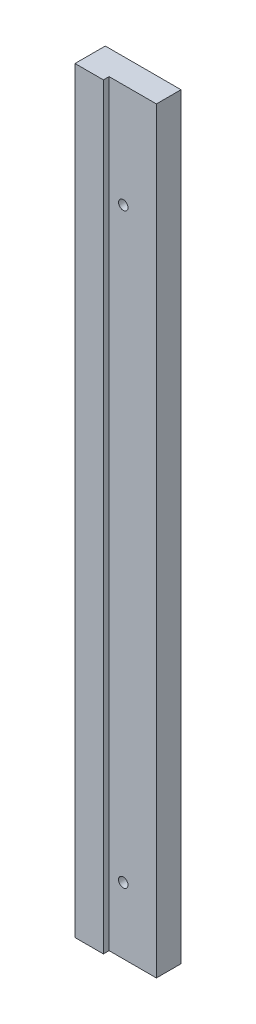
ISO-10303-21;
HEADER;
FILE_DESCRIPTION(('STEP AP214'),'2;1');
FILE_NAME('part.step','',(''),(''),'','','');
FILE_SCHEMA(('AUTOMOTIVE_DESIGN { 1 0 10303 214 1 1 1 1 }'));
ENDSEC;
DATA;
#1=APPLICATION_CONTEXT('core data for automotive mechanical design processes');
#2=APPLICATION_PROTOCOL_DEFINITION('international standard','automotive_design',2000,#1);
#3=PRODUCT_CONTEXT('',#1,'mechanical');
#4=PRODUCT('Part','Part','',(#3));
#5=PRODUCT_RELATED_PRODUCT_CATEGORY('part','',(#4));
#6=PRODUCT_DEFINITION_FORMATION('','',#4);
#7=PRODUCT_DEFINITION_CONTEXT('part definition',#1,'design');
#8=PRODUCT_DEFINITION('design','',#6,#7);
#9=PRODUCT_DEFINITION_SHAPE('','',#8);
#10=(LENGTH_UNIT() NAMED_UNIT(*) SI_UNIT(.MILLI.,.METRE.));
#11=(NAMED_UNIT(*) PLANE_ANGLE_UNIT() SI_UNIT($,.RADIAN.));
#12=(NAMED_UNIT(*) SI_UNIT($,.STERADIAN.) SOLID_ANGLE_UNIT());
#13=UNCERTAINTY_MEASURE_WITH_UNIT(LENGTH_MEASURE(1.E-05),#10,'distance_accuracy_value','');
#14=(GEOMETRIC_REPRESENTATION_CONTEXT(3) GLOBAL_UNCERTAINTY_ASSIGNED_CONTEXT((#13)) GLOBAL_UNIT_ASSIGNED_CONTEXT((#10,
#11,#12)) REPRESENTATION_CONTEXT('',''));
#15=CARTESIAN_POINT('',(0.,0.,0.));
#16=DIRECTION('',(0.,0.,1.));
#17=DIRECTION('',(1.,0.,0.));
#18=AXIS2_PLACEMENT_3D('',#15,#16,#17);
#19=CARTESIAN_POINT('',(20.,200.,16.));
#20=DIRECTION('',(-1.,0.,0.));
#21=DIRECTION('',(0.,-1.,0.));
#22=AXIS2_PLACEMENT_3D('',#19,#20,#21);
#23=PLANE('',#22);
#24=DIRECTION('',(0.,0.,-1.));
#25=VECTOR('',#24,1.);
#26=CARTESIAN_POINT('',(20.,200.,16.));
#27=LINE('',#26,#25);
#28=CARTESIAN_POINT('',(19.9999999999997,200.,13.));
#29=VERTEX_POINT('',#28);
#30=CARTESIAN_POINT('',(20.,200.,0.));
#31=VERTEX_POINT('',#30);
#32=EDGE_CURVE('E11',#29,#31,#27,.T.);
#33=ORIENTED_EDGE('',*,*,#32,.F.);
#34=DIRECTION('',(0.,-1.,0.));
#35=VECTOR('',#34,1.);
#36=CARTESIAN_POINT('',(19.9999999999997,200.001,13.));
#37=LINE('',#36,#35);
#38=CARTESIAN_POINT('',(20.,-200.,13.));
#39=VERTEX_POINT('',#38);
#40=EDGE_CURVE('E89',#29,#39,#37,.T.);
#41=ORIENTED_EDGE('',*,*,#40,.T.);
#42=DIRECTION('',(0.,0.,-1.));
#43=VECTOR('',#42,1.);
#44=CARTESIAN_POINT('',(20.,-200.,16.));
#45=LINE('',#44,#43);
#46=CARTESIAN_POINT('',(20.,-200.,0.));
#47=VERTEX_POINT('',#46);
#48=EDGE_CURVE('E82',#39,#47,#45,.T.);
#49=ORIENTED_EDGE('',*,*,#48,.T.);
#50=DIRECTION('',(0.,1.,0.));
#51=VECTOR('',#50,1.);
#52=CARTESIAN_POINT('',(20.,200.,0.));
#53=LINE('',#52,#51);
#54=EDGE_CURVE('E86',#47,#31,#53,.T.);
#55=ORIENTED_EDGE('',*,*,#54,.T.);
#56=EDGE_LOOP('',(#33,#41,#49,#55));
#57=FACE_BOUND('',#56,.T.);
#58=ADVANCED_FACE('F39',(#57),#23,.F.);
#59=CARTESIAN_POINT('',(-20.,200.,16.));
#60=DIRECTION('',(0.,-1.,0.));
#61=DIRECTION('',(0.,0.,-1.));
#62=AXIS2_PLACEMENT_3D('',#59,#60,#61);
#63=PLANE('',#62);
#64=DIRECTION('',(-1.,0.,0.));
#65=VECTOR('',#64,1.);
#66=CARTESIAN_POINT('',(-20.,200.,16.));
#67=LINE('',#66,#65);
#68=CARTESIAN_POINT('',(-5.00000000000029,200.,16.));
#69=VERTEX_POINT('',#68);
#70=CARTESIAN_POINT('',(-20.,200.,16.));
#71=VERTEX_POINT('',#70);
#72=EDGE_CURVE('E102',#69,#71,#67,.T.);
#73=ORIENTED_EDGE('',*,*,#72,.F.);
#74=DIRECTION('',(0.,0.,1.));
#75=VECTOR('',#74,1.);
#76=CARTESIAN_POINT('',(-5.00000000000029,200.,16.));
#77=LINE('',#76,#75);
#78=CARTESIAN_POINT('',(-5.00000000000029,200.,13.));
#79=VERTEX_POINT('',#78);
#80=EDGE_CURVE('E54',#79,#69,#77,.T.);
#81=ORIENTED_EDGE('',*,*,#80,.F.);
#82=DIRECTION('',(-1.,0.,0.));
#83=VECTOR('',#82,1.);
#84=CARTESIAN_POINT('',(-5.00000000000029,200.,13.));
#85=LINE('',#84,#83);
#86=EDGE_CURVE('E108',#29,#79,#85,.T.);
#87=ORIENTED_EDGE('',*,*,#86,.F.);
#88=ORIENTED_EDGE('',*,*,#32,.T.);
#89=DIRECTION('',(-1.,0.,0.));
#90=VECTOR('',#89,1.);
#91=CARTESIAN_POINT('',(-20.,200.,0.));
#92=LINE('',#91,#90);
#93=CARTESIAN_POINT('',(-20.,200.,0.));
#94=VERTEX_POINT('',#93);
#95=EDGE_CURVE('E107',#31,#94,#92,.T.);
#96=ORIENTED_EDGE('',*,*,#95,.T.);
#97=DIRECTION('',(0.,0.,-1.));
#98=VECTOR('',#97,1.);
#99=CARTESIAN_POINT('',(-20.,200.,16.));
#100=LINE('',#99,#98);
#101=EDGE_CURVE('E47',#71,#94,#100,.T.);
#102=ORIENTED_EDGE('',*,*,#101,.F.);
#103=EDGE_LOOP('',(#73,#81,#87,#88,#96,#102));
#104=FACE_BOUND('',#103,.T.);
#105=ADVANCED_FACE('F125',(#104),#63,.F.);
#106=CARTESIAN_POINT('',(-20.,200.,16.));
#107=DIRECTION('',(1.,0.,0.));
#108=DIRECTION('',(0.,1.,0.));
#109=AXIS2_PLACEMENT_3D('',#106,#107,#108);
#110=PLANE('',#109);
#111=DIRECTION('',(0.,-1.,0.));
#112=VECTOR('',#111,1.);
#113=CARTESIAN_POINT('',(-20.,200.,0.));
#114=LINE('',#113,#112);
#115=CARTESIAN_POINT('',(-20.,-200.,0.));
#116=VERTEX_POINT('',#115);
#117=EDGE_CURVE('E103',#94,#116,#114,.T.);
#118=ORIENTED_EDGE('',*,*,#117,.T.);
#119=DIRECTION('',(0.,0.,-1.));
#120=VECTOR('',#119,1.);
#121=CARTESIAN_POINT('',(-20.,-200.,16.));
#122=LINE('',#121,#120);
#123=CARTESIAN_POINT('',(-20.,-200.,16.));
#124=VERTEX_POINT('',#123);
#125=EDGE_CURVE('E92',#124,#116,#122,.T.);
#126=ORIENTED_EDGE('',*,*,#125,.F.);
#127=DIRECTION('',(0.,-1.,0.));
#128=VECTOR('',#127,1.);
#129=CARTESIAN_POINT('',(-20.,200.,16.));
#130=LINE('',#129,#128);
#131=EDGE_CURVE('E63',#71,#124,#130,.T.);
#132=ORIENTED_EDGE('',*,*,#131,.F.);
#133=ORIENTED_EDGE('',*,*,#101,.T.);
#134=EDGE_LOOP('',(#118,#126,#132,#133));
#135=FACE_BOUND('',#134,.T.);
#136=ADVANCED_FACE('F122',(#135),#110,.F.);
#137=CARTESIAN_POINT('',(-20.,-200.,16.));
#138=DIRECTION('',(0.,1.,0.));
#139=DIRECTION('',(0.,0.,1.));
#140=AXIS2_PLACEMENT_3D('',#137,#138,#139);
#141=PLANE('',#140);
#142=DIRECTION('',(1.,0.,0.));
#143=VECTOR('',#142,1.);
#144=CARTESIAN_POINT('',(-4.99999999999998,-200.,13.));
#145=LINE('',#144,#143);
#146=CARTESIAN_POINT('',(-4.99999999999998,-200.,13.));
#147=VERTEX_POINT('',#146);
#148=EDGE_CURVE('E142',#147,#39,#145,.T.);
#149=ORIENTED_EDGE('',*,*,#148,.F.);
#150=DIRECTION('',(0.,0.,-1.));
#151=VECTOR('',#150,1.);
#152=CARTESIAN_POINT('',(-4.99999999999998,-200.,16.));
#153=LINE('',#152,#151);
#154=CARTESIAN_POINT('',(-4.99999999999998,-200.,16.));
#155=VERTEX_POINT('',#154);
#156=EDGE_CURVE('E141',#155,#147,#153,.T.);
#157=ORIENTED_EDGE('',*,*,#156,.F.);
#158=DIRECTION('',(1.,0.,0.));
#159=VECTOR('',#158,1.);
#160=CARTESIAN_POINT('',(-20.,-200.,16.));
#161=LINE('',#160,#159);
#162=EDGE_CURVE('E93',#124,#155,#161,.T.);
#163=ORIENTED_EDGE('',*,*,#162,.F.);
#164=ORIENTED_EDGE('',*,*,#125,.T.);
#165=DIRECTION('',(1.,0.,0.));
#166=VECTOR('',#165,1.);
#167=CARTESIAN_POINT('',(-20.,-200.,0.));
#168=LINE('',#167,#166);
#169=EDGE_CURVE('E97',#116,#47,#168,.T.);
#170=ORIENTED_EDGE('',*,*,#169,.T.);
#171=ORIENTED_EDGE('',*,*,#48,.F.);
#172=EDGE_LOOP('',(#149,#157,#163,#164,#170,#171));
#173=FACE_BOUND('',#172,.T.);
#174=ADVANCED_FACE('F98',(#173),#141,.F.);
#175=CARTESIAN_POINT('',(0.,0.,16.));
#176=DIRECTION('',(0.,0.,1.));
#177=DIRECTION('',(1.,0.,0.));
#178=AXIS2_PLACEMENT_3D('',#175,#176,#177);
#179=PLANE('',#178);
#180=DIRECTION('',(0.,-1.,0.));
#181=VECTOR('',#180,1.);
#182=CARTESIAN_POINT('',(-5.00000000000029,200.001,16.));
#183=LINE('',#182,#181);
#184=EDGE_CURVE('E112',#69,#155,#183,.T.);
#185=ORIENTED_EDGE('',*,*,#184,.F.);
#186=ORIENTED_EDGE('',*,*,#72,.T.);
#187=ORIENTED_EDGE('',*,*,#131,.T.);
#188=ORIENTED_EDGE('',*,*,#162,.T.);
#189=EDGE_LOOP('',(#185,#186,#187,#188));
#190=FACE_BOUND('',#189,.T.);
#191=ADVANCED_FACE('F156',(#190),#179,.T.);
#192=CARTESIAN_POINT('',(0.,0.,0.));
#193=DIRECTION('',(0.,0.,1.));
#194=DIRECTION('',(1.,0.,0.));
#195=AXIS2_PLACEMENT_3D('',#192,#193,#194);
#196=PLANE('',#195);
#197=CARTESIAN_POINT('',(2.50000000000011,145.,0.));
#198=DIRECTION('',(0.,0.,-1.));
#199=DIRECTION('',(-1.,0.,0.));
#200=AXIS2_PLACEMENT_3D('',#197,#198,#199);
#201=CIRCLE('',#200,2.5);
#202=CARTESIAN_POINT('',(1.15359111152458E-13,145.,0.));
#203=VERTEX_POINT('',#202);
#204=EDGE_CURVE('E249',#203,#203,#201,.T.);
#205=ORIENTED_EDGE('',*,*,#204,.F.);
#206=EDGE_LOOP('',(#205));
#207=FACE_BOUND('',#206,.T.);
#208=CARTESIAN_POINT('',(2.50000000000009,-165.,0.));
#209=DIRECTION('',(0.,0.,-1.));
#210=DIRECTION('',(-1.,0.,0.));
#211=AXIS2_PLACEMENT_3D('',#208,#209,#210);
#212=CIRCLE('',#211,2.5);
#213=CARTESIAN_POINT('',(0.,-165.,0.));
#214=VERTEX_POINT('',#213);
#215=EDGE_CURVE('E149',#214,#214,#212,.T.);
#216=ORIENTED_EDGE('',*,*,#215,.F.);
#217=EDGE_LOOP('',(#216));
#218=FACE_BOUND('',#217,.T.);
#219=ORIENTED_EDGE('',*,*,#54,.F.);
#220=ORIENTED_EDGE('',*,*,#169,.F.);
#221=ORIENTED_EDGE('',*,*,#117,.F.);
#222=ORIENTED_EDGE('',*,*,#95,.F.);
#223=EDGE_LOOP('',(#219,#220,#221,#222));
#224=FACE_BOUND('',#223,.T.);
#225=ADVANCED_FACE('F106',(#207,#218,#224),#196,.F.);
#226=CARTESIAN_POINT('',(-5.00000000000029,200.001,16.));
#227=DIRECTION('',(-1.,0.,0.));
#228=DIRECTION('',(0.,-1.,0.));
#229=AXIS2_PLACEMENT_3D('',#226,#227,#228);
#230=PLANE('',#229);
#231=ORIENTED_EDGE('',*,*,#80,.T.);
#232=ORIENTED_EDGE('',*,*,#184,.T.);
#233=ORIENTED_EDGE('',*,*,#156,.T.);
#234=DIRECTION('',(0.,-1.,0.));
#235=VECTOR('',#234,1.);
#236=CARTESIAN_POINT('',(-5.00000000000029,200.001,13.));
#237=LINE('',#236,#235);
#238=EDGE_CURVE('E138',#79,#147,#237,.T.);
#239=ORIENTED_EDGE('',*,*,#238,.F.);
#240=EDGE_LOOP('',(#231,#232,#233,#239));
#241=FACE_BOUND('',#240,.T.);
#242=ADVANCED_FACE('F139',(#241),#230,.F.);
#243=CARTESIAN_POINT('',(-5.00000000000029,200.001,13.));
#244=DIRECTION('',(0.,0.,-1.));
#245=DIRECTION('',(-1.,0.,0.));
#246=AXIS2_PLACEMENT_3D('',#243,#244,#245);
#247=PLANE('',#246);
#248=CARTESIAN_POINT('',(2.50000000000011,145.,13.));
#249=DIRECTION('',(0.,0.,-1.));
#250=DIRECTION('',(-1.,0.,0.));
#251=AXIS2_PLACEMENT_3D('',#248,#249,#250);
#252=CIRCLE('',#251,2.5);
#253=CARTESIAN_POINT('',(1.1666015375944E-13,145.,13.));
#254=VERTEX_POINT('',#253);
#255=EDGE_CURVE('E42',#254,#254,#252,.T.);
#256=ORIENTED_EDGE('',*,*,#255,.T.);
#257=EDGE_LOOP('',(#256));
#258=FACE_BOUND('',#257,.T.);
#259=CARTESIAN_POINT('',(2.50000000000009,-165.,13.));
#260=DIRECTION('',(0.,0.,-1.));
#261=DIRECTION('',(-1.,0.,0.));
#262=AXIS2_PLACEMENT_3D('',#259,#260,#261);
#263=CIRCLE('',#262,2.5);
#264=CARTESIAN_POINT('',(0.,-165.,13.));
#265=VERTEX_POINT('',#264);
#266=EDGE_CURVE('E145',#265,#265,#263,.T.);
#267=ORIENTED_EDGE('',*,*,#266,.T.);
#268=EDGE_LOOP('',(#267));
#269=FACE_BOUND('',#268,.T.);
#270=ORIENTED_EDGE('',*,*,#86,.T.);
#271=ORIENTED_EDGE('',*,*,#238,.T.);
#272=ORIENTED_EDGE('',*,*,#148,.T.);
#273=ORIENTED_EDGE('',*,*,#40,.F.);
#274=EDGE_LOOP('',(#270,#271,#272,#273));
#275=FACE_BOUND('',#274,.T.);
#276=ADVANCED_FACE('F144',(#258,#269,#275),#247,.F.);
#277=CARTESIAN_POINT('',(2.50000000000009,-165.,0.));
#278=DIRECTION('',(0.,0.,-1.));
#279=DIRECTION('',(-1.,0.,0.));
#280=AXIS2_PLACEMENT_3D('',#277,#278,#279);
#281=CYLINDRICAL_SURFACE('',#280,2.5);
#282=ORIENTED_EDGE('',*,*,#215,.T.);
#283=EDGE_LOOP('',(#282));
#284=FACE_BOUND('',#283,.T.);
#285=ORIENTED_EDGE('',*,*,#266,.F.);
#286=EDGE_LOOP('',(#285));
#287=FACE_BOUND('',#286,.T.);
#288=ADVANCED_FACE('F214',(#284,#287),#281,.F.);
#289=CARTESIAN_POINT('',(2.50000000000011,145.,0.));
#290=DIRECTION('',(0.,0.,-1.));
#291=DIRECTION('',(-1.,0.,0.));
#292=AXIS2_PLACEMENT_3D('',#289,#290,#291);
#293=CYLINDRICAL_SURFACE('',#292,2.5);
#294=ORIENTED_EDGE('',*,*,#204,.T.);
#295=EDGE_LOOP('',(#294));
#296=FACE_BOUND('',#295,.T.);
#297=ORIENTED_EDGE('',*,*,#255,.F.);
#298=EDGE_LOOP('',(#297));
#299=FACE_BOUND('',#298,.T.);
#300=ADVANCED_FACE('F225',(#296,#299),#293,.F.);
#301=CLOSED_SHELL('',(#58,#105,#136,#174,#191,#225,#242,#276,#288,#300));
#302=MANIFOLD_SOLID_BREP('B2',#301);
#303=ADVANCED_BREP_SHAPE_REPRESENTATION('',(#18,#302),#14);
#304=SHAPE_DEFINITION_REPRESENTATION(#9,#303);
ENDSEC;
END-ISO-10303-21;
